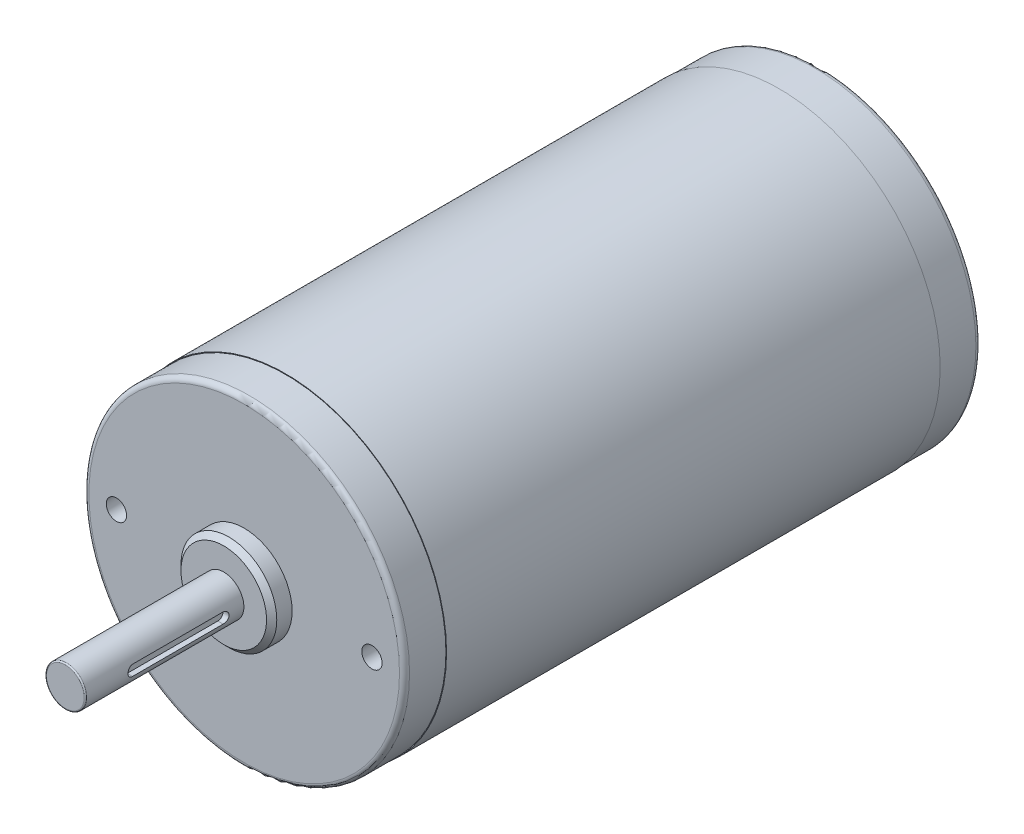
ISO-10303-21;
HEADER;
FILE_DESCRIPTION(('STEP AP214'),'2;1');
FILE_NAME('part.step','',(''),(''),'','','');
FILE_SCHEMA(('AUTOMOTIVE_DESIGN { 1 0 10303 214 1 1 1 1 }'));
ENDSEC;
DATA;
#1=APPLICATION_CONTEXT('core data for automotive mechanical design processes');
#2=APPLICATION_PROTOCOL_DEFINITION('international standard','automotive_design',2000,#1);
#3=PRODUCT_CONTEXT('',#1,'mechanical');
#4=PRODUCT('Part','Part','',(#3));
#5=PRODUCT_RELATED_PRODUCT_CATEGORY('part','',(#4));
#6=PRODUCT_DEFINITION_FORMATION('','',#4);
#7=PRODUCT_DEFINITION_CONTEXT('part definition',#1,'design');
#8=PRODUCT_DEFINITION('design','',#6,#7);
#9=PRODUCT_DEFINITION_SHAPE('','',#8);
#10=(LENGTH_UNIT() NAMED_UNIT(*) SI_UNIT(.MILLI.,.METRE.));
#11=(NAMED_UNIT(*) PLANE_ANGLE_UNIT() SI_UNIT($,.RADIAN.));
#12=(NAMED_UNIT(*) SI_UNIT($,.STERADIAN.) SOLID_ANGLE_UNIT());
#13=UNCERTAINTY_MEASURE_WITH_UNIT(LENGTH_MEASURE(1.E-05),#10,'distance_accuracy_value','');
#14=(GEOMETRIC_REPRESENTATION_CONTEXT(3) GLOBAL_UNCERTAINTY_ASSIGNED_CONTEXT((#13)) GLOBAL_UNIT_ASSIGNED_CONTEXT((#10,
#11,#12)) REPRESENTATION_CONTEXT('',''));
#15=CARTESIAN_POINT('',(0.,0.,0.));
#16=DIRECTION('',(0.,0.,1.));
#17=DIRECTION('',(1.,0.,0.));
#18=AXIS2_PLACEMENT_3D('',#15,#16,#17);
#19=CARTESIAN_POINT('',(35.56,109.2962,54.614));
#20=DIRECTION('',(0.,0.,1.));
#21=DIRECTION('',(1.,0.,0.));
#22=AXIS2_PLACEMENT_3D('',#19,#20,#21);
#23=PLANE('',#22);
#24=CARTESIAN_POINT('',(35.56,109.2962,54.614));
#25=DIRECTION('',(0.,0.,-1.));
#26=DIRECTION('',(1.,0.,0.));
#27=AXIS2_PLACEMENT_3D('',#24,#25,#26);
#28=CIRCLE('',#27,3.7460000000201);
#29=CARTESIAN_POINT('',(39.3060000000201,109.2962,54.614));
#30=VERTEX_POINT('',#29);
#31=EDGE_CURVE('E76',#30,#30,#28,.T.);
#32=ORIENTED_EDGE('',*,*,#31,.F.);
#33=EDGE_LOOP('',(#32));
#34=FACE_BOUND('',#33,.T.);
#35=ADVANCED_FACE('F17',(#34),#23,.T.);
#36=CARTESIAN_POINT('',(38.36,109.2962,16.4984772078548));
#37=DIRECTION('',(1.,0.,0.));
#38=DIRECTION('',(0.,0.,-1.));
#39=AXIS2_PLACEMENT_3D('',#36,#37,#38);
#40=PLANE('',#39);
#41=DIRECTION('',(0.,0.,1.));
#42=VECTOR('',#41,1.);
#43=CARTESIAN_POINT('',(38.36,108.2462,16.4984772078548));
#44=LINE('',#43,#42);
#45=CARTESIAN_POINT('',(38.36,108.2462,27.1));
#46=VERTEX_POINT('',#45);
#47=CARTESIAN_POINT('',(38.36,108.2462,45.1));
#48=VERTEX_POINT('',#47);
#49=EDGE_CURVE('E58',#46,#48,#44,.T.);
#50=ORIENTED_EDGE('',*,*,#49,.F.);
#51=CARTESIAN_POINT('',(38.36,109.2962,27.1));
#52=DIRECTION('',(-1.,0.,0.));
#53=DIRECTION('',(0.,0.,1.));
#54=AXIS2_PLACEMENT_3D('',#51,#52,#53);
#55=CIRCLE('',#54,1.05);
#56=CARTESIAN_POINT('',(38.36,110.3462,27.1));
#57=VERTEX_POINT('',#56);
#58=EDGE_CURVE('E21',#46,#57,#55,.F.);
#59=ORIENTED_EDGE('',*,*,#58,.T.);
#60=DIRECTION('',(0.,0.,1.));
#61=VECTOR('',#60,1.);
#62=CARTESIAN_POINT('',(38.36,110.3462,16.4984772078548));
#63=LINE('',#62,#61);
#64=CARTESIAN_POINT('',(38.36,110.3462,45.1));
#65=VERTEX_POINT('',#64);
#66=EDGE_CURVE('E88',#57,#65,#63,.T.);
#67=ORIENTED_EDGE('',*,*,#66,.T.);
#68=CARTESIAN_POINT('',(38.36,109.2962,45.1));
#69=DIRECTION('',(-1.,0.,0.));
#70=DIRECTION('',(0.,0.,1.));
#71=AXIS2_PLACEMENT_3D('',#68,#69,#70);
#72=CIRCLE('',#71,1.05);
#73=EDGE_CURVE('E63',#65,#48,#72,.F.);
#74=ORIENTED_EDGE('',*,*,#73,.T.);
#75=EDGE_LOOP('',(#50,#59,#67,#74));
#76=FACE_BOUND('',#75,.T.);
#77=ADVANCED_FACE('F60',(#76),#40,.T.);
#78=CARTESIAN_POINT('',(35.56,109.2962,54.36));
#79=DIRECTION('',(0.,0.,1.));
#80=DIRECTION('',(1.,0.,0.));
#81=AXIS2_PLACEMENT_3D('',#78,#79,#80);
#82=TOROIDAL_SURFACE('',#81,3.746,0.254);
#83=CARTESIAN_POINT('',(35.56,109.2962,54.36000000001));
#84=DIRECTION('',(0.,0.,1.));
#85=DIRECTION('',(1.,0.,0.));
#86=AXIS2_PLACEMENT_3D('',#83,#84,#85);
#87=CIRCLE('',#86,4.);
#88=CARTESIAN_POINT('',(39.56,109.2962,54.36000000001));
#89=VERTEX_POINT('',#88);
#90=EDGE_CURVE('E330',#89,#89,#87,.F.);
#91=ORIENTED_EDGE('',*,*,#90,.F.);
#92=EDGE_LOOP('',(#91));
#93=FACE_BOUND('',#92,.T.);
#94=ORIENTED_EDGE('',*,*,#31,.T.);
#95=EDGE_LOOP('',(#94));
#96=FACE_BOUND('',#95,.T.);
#97=ADVANCED_FACE('F90',(#93,#96),#82,.T.);
#98=CARTESIAN_POINT('',(38.36,109.2962,27.1));
#99=DIRECTION('',(-1.,0.,0.));
#100=DIRECTION('',(0.,0.,1.));
#101=AXIS2_PLACEMENT_3D('',#98,#99,#100);
#102=CYLINDRICAL_SURFACE('',#101,1.05);
#103=ORIENTED_EDGE('',*,*,#58,.F.);
#104=DIRECTION('',(1.,0.,0.));
#105=VECTOR('',#104,1.);
#106=CARTESIAN_POINT('',(38.36,108.2462,27.1));
#107=LINE('',#106,#105);
#108=CARTESIAN_POINT('',(39.4197279696891,108.2462,27.1));
#109=VERTEX_POINT('',#108);
#110=EDGE_CURVE('E68',#109,#46,#107,.F.);
#111=ORIENTED_EDGE('',*,*,#110,.F.);
#112=CARTESIAN_POINT('',(39.4197279696891,110.3462,27.1));
#113=CARTESIAN_POINT('',(39.4197258950768,110.34620041025,27.0710051009623));
#114=CARTESIAN_POINT('',(39.4200551064328,110.344998227256,27.0420246228058));
#115=CARTESIAN_POINT('',(39.4213547123987,110.340206209835,26.9842814282389));
#116=CARTESIAN_POINT('',(39.4223249908092,110.336616808112,26.9555186733196));
#117=CARTESIAN_POINT('',(39.4261578920523,110.322321932764,26.8699951160553));
#118=CARTESIAN_POINT('',(39.4299428342911,110.308089542303,26.8138236492985));
#119=CARTESIAN_POINT('',(39.4395286889103,110.270686835054,26.7047742036821));
#120=CARTESIAN_POINT('',(39.445329326456,110.247517736714,26.6518957769836));
#121=CARTESIAN_POINT('',(39.4582892232805,110.192930496084,26.5507488556207));
#122=CARTESIAN_POINT('',(39.4654488628843,110.161510043656,26.5024816571346));
#123=CARTESIAN_POINT('',(39.4805119710477,110.090509636998,26.4107922298844));
#124=CARTESIAN_POINT('',(39.4884281885094,110.050767743087,26.3674975328551));
#125=CARTESIAN_POINT('',(39.5040047400554,109.964586854037,26.2880931254824));
#126=CARTESIAN_POINT('',(39.5116649818292,109.91814547434,26.2519859843525));
#127=CARTESIAN_POINT('',(39.526010604883,109.818987620195,26.1874496103786));
#128=CARTESIAN_POINT('',(39.5326785635433,109.766183168704,26.159151481312));
#129=CARTESIAN_POINT('',(39.5441298010582,109.656397945762,26.1119111599868));
#130=CARTESIAN_POINT('',(39.5489153447306,109.599422291421,26.0929577177131));
#131=CARTESIAN_POINT('',(39.5549473168841,109.501171577289,26.0693758272655));
#132=CARTESIAN_POINT('',(39.5568321627735,109.46054623456,26.0621227253234));
#133=CARTESIAN_POINT('',(39.5593590428506,109.378686103609,26.052433965248));
#134=CARTESIAN_POINT('',(39.5600011009139,109.337451327111,26.0499982145665));
#135=CARTESIAN_POINT('',(39.55999845492,109.238305738357,26.0500025057704));
#136=CARTESIAN_POINT('',(39.5587300938833,109.180378877339,26.0548061723029));
#137=CARTESIAN_POINT('',(39.5537908073877,109.066174828257,26.0738680806171));
#138=CARTESIAN_POINT('',(39.5501176251492,109.009899241695,26.0881352034471));
#139=CARTESIAN_POINT('',(39.5407752151886,108.900688958064,26.1256289904428));
#140=CARTESIAN_POINT('',(39.5351088856793,108.847749541003,26.148842650214));
#141=CARTESIAN_POINT('',(39.5223803452477,108.746519851806,26.2035277086069));
#142=CARTESIAN_POINT('',(39.5153181479082,108.698229534436,26.2349990268771));
#143=CARTESIAN_POINT('',(39.5003832391546,108.606575585264,26.3060552920619));
#144=CARTESIAN_POINT('',(39.4924970081333,108.563331555532,26.3457916691671));
#145=CARTESIAN_POINT('',(39.4768899553604,108.484036309153,26.431929982209));
#146=CARTESIAN_POINT('',(39.4691691622904,108.447986330864,26.4783330633665));
#147=CARTESIAN_POINT('',(39.4546281048764,108.383519395399,26.5774412854526));
#148=CARTESIAN_POINT('',(39.4478252173029,108.355241372008,26.6302394851058));
#149=CARTESIAN_POINT('',(39.4360941322254,108.308025058775,26.7400354515098));
#150=CARTESIAN_POINT('',(39.4311644713834,108.289079475123,26.7970298984879));
#151=CARTESIAN_POINT('',(39.424947536189,108.265530062073,26.8952701656664));
#152=CARTESIAN_POINT('',(39.4230031721685,108.258293447667,26.9358624533813));
#153=CARTESIAN_POINT('',(39.4203876966156,108.248624950633,27.0176289590907));
#154=CARTESIAN_POINT('',(39.4197157897859,108.246190066839,27.058802797386));
#155=CARTESIAN_POINT('',(39.4197279696891,108.2462,27.1));
#156=B_SPLINE_CURVE_WITH_KNOTS('',3,(#112,#113,#114,#115,#116,#117,#118,#119,#120,#121,#122,
#123,#124,#125,#126,#127,#128,#129,#130,#131,#132,#133,#134,#135,#136,#137,#138,#139,#140,#141,
#142,#143,#144,#145,#146,#147,#148,#149,#150,#151,#152,#153,#154,#155),.UNSPECIFIED.,.F.,.F.,(4,
2,2,2,2,2,2,2,2,2,2,2,2,2,2,2,2,2,2,2,2,4),(0.,0.0869295778834455,0.173843403286118,
0.347151826879624,0.520436629596133,0.693769998810187,0.870856390838599,1.04800596970822,
1.22797015523126,1.40771715061753,1.53136439682191,1.65500926755904,1.8285389209936,
2.00223165541559,2.17567286221396,2.34911238140169,2.52606492372391,2.70304789975981,
2.88301467869372,3.06284057971519,3.18638852057382,3.30985921734619),.UNSPECIFIED.);
#157=CARTESIAN_POINT('',(39.4197279696891,110.3462,27.1));
#158=VERTEX_POINT('',#157);
#159=EDGE_CURVE('E161',#158,#109,#156,.T.);
#160=ORIENTED_EDGE('',*,*,#159,.F.);
#161=DIRECTION('',(1.,0.,0.));
#162=VECTOR('',#161,1.);
#163=CARTESIAN_POINT('',(38.36,110.3462,27.1));
#164=LINE('',#163,#162);
#165=EDGE_CURVE('E74',#158,#57,#164,.F.);
#166=ORIENTED_EDGE('',*,*,#165,.T.);
#167=EDGE_LOOP('',(#103,#111,#160,#166));
#168=FACE_BOUND('',#167,.T.);
#169=ADVANCED_FACE('F71',(#168),#102,.F.);
#170=CARTESIAN_POINT('',(38.36,108.2462,16.4984772078548));
#171=DIRECTION('',(0.,1.,0.));
#172=DIRECTION('',(0.,0.,1.));
#173=AXIS2_PLACEMENT_3D('',#170,#171,#172);
#174=PLANE('',#173);
#175=DIRECTION('',(0.,0.,1.));
#176=VECTOR('',#175,1.);
#177=CARTESIAN_POINT('',(39.4197279696891,108.2462,54.614));
#178=LINE('',#177,#176);
#179=CARTESIAN_POINT('',(39.4197279696891,108.2462,45.1));
#180=VERTEX_POINT('',#179);
#181=EDGE_CURVE('E79',#109,#180,#178,.T.);
#182=ORIENTED_EDGE('',*,*,#181,.F.);
#183=ORIENTED_EDGE('',*,*,#110,.T.);
#184=ORIENTED_EDGE('',*,*,#49,.T.);
#185=DIRECTION('',(-1.,0.,0.));
#186=VECTOR('',#185,1.);
#187=CARTESIAN_POINT('',(38.36,108.2462,45.1));
#188=LINE('',#187,#186);
#189=EDGE_CURVE('E82',#48,#180,#188,.F.);
#190=ORIENTED_EDGE('',*,*,#189,.T.);
#191=EDGE_LOOP('',(#182,#183,#184,#190));
#192=FACE_BOUND('',#191,.T.);
#193=ADVANCED_FACE('F77',(#192),#174,.T.);
#194=CARTESIAN_POINT('',(38.36,109.2962,45.1));
#195=DIRECTION('',(-1.,0.,0.));
#196=DIRECTION('',(0.,0.,1.));
#197=AXIS2_PLACEMENT_3D('',#194,#195,#196);
#198=CYLINDRICAL_SURFACE('',#197,1.05);
#199=ORIENTED_EDGE('',*,*,#73,.F.);
#200=DIRECTION('',(1.,0.,0.));
#201=VECTOR('',#200,1.);
#202=CARTESIAN_POINT('',(38.36,110.3462,45.1));
#203=LINE('',#202,#201);
#204=CARTESIAN_POINT('',(39.4197279696891,110.3462,45.1));
#205=VERTEX_POINT('',#204);
#206=EDGE_CURVE('E333',#65,#205,#203,.T.);
#207=ORIENTED_EDGE('',*,*,#206,.T.);
#208=CARTESIAN_POINT('',(39.4197279696891,108.2462,45.1));
#209=CARTESIAN_POINT('',(39.4197258950768,108.24619958975,45.1289948990377));
#210=CARTESIAN_POINT('',(39.4200551064328,108.247401772744,45.1579753771942));
#211=CARTESIAN_POINT('',(39.4213547123987,108.252193790165,45.2157185717611));
#212=CARTESIAN_POINT('',(39.4223249908092,108.255783191888,45.2444813266804));
#213=CARTESIAN_POINT('',(39.4261578920523,108.270078067236,45.3300048839447));
#214=CARTESIAN_POINT('',(39.4299428342911,108.284310457697,45.3861763507015));
#215=CARTESIAN_POINT('',(39.4395286889103,108.321713164946,45.4952257963179));
#216=CARTESIAN_POINT('',(39.445329326456,108.344882263286,45.5481042230164));
#217=CARTESIAN_POINT('',(39.4582892232805,108.399469503916,45.6492511443793));
#218=CARTESIAN_POINT('',(39.4654488628843,108.430889956344,45.6975183428654));
#219=CARTESIAN_POINT('',(39.4805119710477,108.501890363002,45.7892077701156));
#220=CARTESIAN_POINT('',(39.4884281885094,108.541632256913,45.8325024671449));
#221=CARTESIAN_POINT('',(39.5040047400554,108.627813145963,45.9119068745175));
#222=CARTESIAN_POINT('',(39.5116649818292,108.67425452566,45.9480140156475));
#223=CARTESIAN_POINT('',(39.526010604883,108.773412379805,46.0125503896214));
#224=CARTESIAN_POINT('',(39.5326785635433,108.826216831296,46.040848518688));
#225=CARTESIAN_POINT('',(39.5441298010582,108.936002054238,46.0880888400132));
#226=CARTESIAN_POINT('',(39.5489153447306,108.992977708579,46.1070422822868));
#227=CARTESIAN_POINT('',(39.5549473168841,109.091228422711,46.1306241727345));
#228=CARTESIAN_POINT('',(39.5568321627735,109.13185376544,46.1378772746766));
#229=CARTESIAN_POINT('',(39.5593590428506,109.213713896391,46.147566034752));
#230=CARTESIAN_POINT('',(39.560001100914,109.254948672889,46.1500017854335));
#231=CARTESIAN_POINT('',(39.55999845492,109.354094261643,46.1499974942296));
#232=CARTESIAN_POINT('',(39.5587300938833,109.412021122661,46.1451938276971));
#233=CARTESIAN_POINT('',(39.5537908073877,109.526225171743,46.1261319193829));
#234=CARTESIAN_POINT('',(39.5501176251492,109.582500758305,46.1118647965529));
#235=CARTESIAN_POINT('',(39.5407752151886,109.691711041936,46.0743710095572));
#236=CARTESIAN_POINT('',(39.5351088856793,109.744650458997,46.051157349786));
#237=CARTESIAN_POINT('',(39.5223803452477,109.845880148194,45.9964722913931));
#238=CARTESIAN_POINT('',(39.5153181479082,109.894170465564,45.9650009731229));
#239=CARTESIAN_POINT('',(39.5003832391546,109.985824414736,45.8939447079381));
#240=CARTESIAN_POINT('',(39.4924970081333,110.029068444468,45.8542083308329));
#241=CARTESIAN_POINT('',(39.4768899553604,110.108363690847,45.768070017791));
#242=CARTESIAN_POINT('',(39.4691691622904,110.144413669136,45.7216669366335));
#243=CARTESIAN_POINT('',(39.4546281048764,110.208880604601,45.6225587145474));
#244=CARTESIAN_POINT('',(39.4478252173029,110.237158627992,45.5697605148942));
#245=CARTESIAN_POINT('',(39.4360941322254,110.284374941225,45.4599645484902));
#246=CARTESIAN_POINT('',(39.4311644713834,110.303320524877,45.4029701015121));
#247=CARTESIAN_POINT('',(39.424947536189,110.326869937927,45.3047298343336));
#248=CARTESIAN_POINT('',(39.4230031721685,110.334106552333,45.2641375466187));
#249=CARTESIAN_POINT('',(39.4203876966156,110.343775049367,45.1823710409093));
#250=CARTESIAN_POINT('',(39.4197157897859,110.346209933161,45.141197202614));
#251=CARTESIAN_POINT('',(39.4197279696891,110.3462,45.1));
#252=B_SPLINE_CURVE_WITH_KNOTS('',3,(#208,#209,#210,#211,#212,#213,#214,#215,#216,#217,#218,
#219,#220,#221,#222,#223,#224,#225,#226,#227,#228,#229,#230,#231,#232,#233,#234,#235,#236,#237,
#238,#239,#240,#241,#242,#243,#244,#245,#246,#247,#248,#249,#250,#251),.UNSPECIFIED.,.F.,.F.,(4,
2,2,2,2,2,2,2,2,2,2,2,2,2,2,2,2,2,2,2,2,4),(0.,0.0869295778834421,0.173843403286125,
0.347151826879624,0.520436629596126,0.693769998810186,0.870856390838596,1.04800596970822,
1.22797015523124,1.40771715061751,1.53136439682191,1.65500926755904,1.8285389209936,
2.00223165541559,2.17567286221396,2.34911238140169,2.52606492372391,2.70304789975981,
2.88301467869373,3.0628405797152,3.18638852057382,3.30985921734619),.UNSPECIFIED.);
#253=EDGE_CURVE('E153',#180,#205,#252,.T.);
#254=ORIENTED_EDGE('',*,*,#253,.F.);
#255=ORIENTED_EDGE('',*,*,#189,.F.);
#256=EDGE_LOOP('',(#199,#207,#254,#255));
#257=FACE_BOUND('',#256,.T.);
#258=ADVANCED_FACE('F165',(#257),#198,.F.);
#259=CARTESIAN_POINT('',(38.36,110.3462,16.4984772078548));
#260=DIRECTION('',(0.,1.,0.));
#261=DIRECTION('',(0.,0.,1.));
#262=AXIS2_PLACEMENT_3D('',#259,#260,#261);
#263=PLANE('',#262);
#264=ORIENTED_EDGE('',*,*,#206,.F.);
#265=ORIENTED_EDGE('',*,*,#66,.F.);
#266=ORIENTED_EDGE('',*,*,#165,.F.);
#267=DIRECTION('',(0.,0.,1.));
#268=VECTOR('',#267,1.);
#269=CARTESIAN_POINT('',(39.4197279696891,110.3462,54.614));
#270=LINE('',#269,#268);
#271=EDGE_CURVE('E152',#205,#158,#270,.F.);
#272=ORIENTED_EDGE('',*,*,#271,.F.);
#273=EDGE_LOOP('',(#264,#265,#266,#272));
#274=FACE_BOUND('',#273,.T.);
#275=ADVANCED_FACE('F173',(#274),#263,.F.);
#276=CARTESIAN_POINT('',(35.56,109.2962,54.614));
#277=DIRECTION('',(0.,0.,1.));
#278=DIRECTION('',(1.,0.,0.));
#279=AXIS2_PLACEMENT_3D('',#276,#277,#278);
#280=CYLINDRICAL_SURFACE('',#279,4.);
#281=ORIENTED_EDGE('',*,*,#253,.T.);
#282=ORIENTED_EDGE('',*,*,#271,.T.);
#283=ORIENTED_EDGE('',*,*,#159,.T.);
#284=ORIENTED_EDGE('',*,*,#181,.T.);
#285=EDGE_LOOP('',(#281,#282,#283,#284));
#286=FACE_BOUND('',#285,.T.);
#287=ORIENTED_EDGE('',*,*,#90,.T.);
#288=EDGE_LOOP('',(#287));
#289=FACE_BOUND('',#288,.T.);
#290=CARTESIAN_POINT('',(35.56,109.2962,23.11400000001));
#291=DIRECTION('',(0.,0.,1.));
#292=DIRECTION('',(1.,0.,0.));
#293=AXIS2_PLACEMENT_3D('',#290,#291,#292);
#294=CIRCLE('',#293,4.);
#295=CARTESIAN_POINT('',(39.56,109.2962,23.11400000001));
#296=VERTEX_POINT('',#295);
#297=EDGE_CURVE('E149',#296,#296,#294,.F.);
#298=ORIENTED_EDGE('',*,*,#297,.F.);
#299=EDGE_LOOP('',(#298));
#300=FACE_BOUND('',#299,.T.);
#301=ADVANCED_FACE('F168',(#286,#289,#300),#280,.T.);
#302=CARTESIAN_POINT('',(48.8853596371201,127.903290682857,-97.8026999980236));
#303=DIRECTION('',(0.,0.,-1.));
#304=DIRECTION('',(-1.,0.,0.));
#305=AXIS2_PLACEMENT_3D('',#302,#303,#304);
#306=PLANE('',#305);
#307=CARTESIAN_POINT('',(46.76735963712,127.903290682857,-97.8026999970893));
#308=DIRECTION('',(0.,0.,1.));
#309=DIRECTION('',(1.,0.,0.));
#310=AXIS2_PLACEMENT_3D('',#307,#308,#309);
#311=CIRCLE('',#310,2.1179999989541);
#312=CARTESIAN_POINT('',(48.8853596360741,127.903290682857,-97.8026999970893));
#313=VERTEX_POINT('',#312);
#314=EDGE_CURVE('E146',#313,#313,#311,.T.);
#315=ORIENTED_EDGE('',*,*,#314,.F.);
#316=EDGE_LOOP('',(#315));
#317=FACE_BOUND('',#316,.T.);
#318=ADVANCED_FACE('F172',(#317),#306,.T.);
#319=CARTESIAN_POINT('',(56.2850906808812,120.503559639096,-97.8026999980238));
#320=DIRECTION('',(0.,0.,-1.));
#321=DIRECTION('',(-1.,0.,0.));
#322=AXIS2_PLACEMENT_3D('',#319,#320,#321);
#323=PLANE('',#322);
#324=CARTESIAN_POINT('',(54.1670906808811,120.503559639096,-97.8026999970325));
#325=DIRECTION('',(0.,0.,1.));
#326=DIRECTION('',(1.,0.,0.));
#327=AXIS2_PLACEMENT_3D('',#324,#325,#326);
#328=CIRCLE('',#327,2.11799999904017);
#329=CARTESIAN_POINT('',(56.2850906799213,120.503559639096,-97.8026999970325));
#330=VERTEX_POINT('',#329);
#331=EDGE_CURVE('E143',#330,#330,#328,.T.);
#332=ORIENTED_EDGE('',*,*,#331,.F.);
#333=EDGE_LOOP('',(#332));
#334=FACE_BOUND('',#333,.T.);
#335=ADVANCED_FACE('F426',(#334),#323,.T.);
#336=CARTESIAN_POINT('',(35.56,109.2962,-100.317299999998));
#337=DIRECTION('',(0.,0.,-1.));
#338=DIRECTION('',(-1.,0.,0.));
#339=AXIS2_PLACEMENT_3D('',#336,#337,#338);
#340=PLANE('',#339);
#341=CARTESIAN_POINT('',(35.56,109.2962,-100.317299999998));
#342=DIRECTION('',(0.,0.,1.));
#343=DIRECTION('',(-1.,0.,0.));
#344=AXIS2_PLACEMENT_3D('',#341,#342,#343);
#345=CIRCLE('',#344,14.0368000000003);
#346=CARTESIAN_POINT('',(21.5231999999997,109.2962,-100.317299999998));
#347=VERTEX_POINT('',#346);
#348=EDGE_CURVE('E142',#347,#347,#345,.T.);
#349=ORIENTED_EDGE('',*,*,#348,.F.);
#350=EDGE_LOOP('',(#349));
#351=FACE_BOUND('',#350,.T.);
#352=ADVANCED_FACE('F346',(#351),#340,.T.);
#353=CARTESIAN_POINT('',(35.56,109.2962,23.114));
#354=DIRECTION('',(0.,0.,1.));
#355=DIRECTION('',(1.,0.,0.));
#356=AXIS2_PLACEMENT_3D('',#353,#354,#355);
#357=PLANE('',#356);
#358=ORIENTED_EDGE('',*,*,#297,.T.);
#359=EDGE_LOOP('',(#358));
#360=FACE_BOUND('',#359,.T.);
#361=CARTESIAN_POINT('',(35.56,109.2962,23.1139999999949));
#362=DIRECTION('',(0.,0.,-1.));
#363=DIRECTION('',(-1.,0.,0.));
#364=AXIS2_PLACEMENT_3D('',#361,#362,#363);
#365=CIRCLE('',#364,8.5090000018283);
#366=CARTESIAN_POINT('',(27.0509999981717,109.2962,23.1139999999949));
#367=VERTEX_POINT('',#366);
#368=EDGE_CURVE('E138',#367,#367,#365,.T.);
#369=ORIENTED_EDGE('',*,*,#368,.F.);
#370=EDGE_LOOP('',(#369));
#371=FACE_BOUND('',#370,.T.);
#372=ADVANCED_FACE('F342',(#360,#371),#357,.T.);
#373=CARTESIAN_POINT('',(46.76735963712,127.903290682857,-95.6026999950836));
#374=DIRECTION('',(0.,0.,1.));
#375=DIRECTION('',(1.,0.,0.));
#376=AXIS2_PLACEMENT_3D('',#373,#374,#375);
#377=CONICAL_SURFACE('',#376,4.31800000095981,0.785398163397448);
#378=ORIENTED_EDGE('',*,*,#314,.T.);
#379=EDGE_LOOP('',(#378));
#380=FACE_BOUND('',#379,.T.);
#381=CARTESIAN_POINT('',(46.76735963712,127.903290682857,-95.6026999960591));
#382=DIRECTION('',(0.,0.,-1.));
#383=DIRECTION('',(-1.,0.,0.));
#384=AXIS2_PLACEMENT_3D('',#381,#382,#383);
#385=CIRCLE('',#384,4.318);
#386=CARTESIAN_POINT('',(42.44935963712,127.903290682857,-95.6026999960591));
#387=VERTEX_POINT('',#386);
#388=EDGE_CURVE('E141',#387,#387,#385,.F.);
#389=ORIENTED_EDGE('',*,*,#388,.F.);
#390=EDGE_LOOP('',(#389));
#391=FACE_BOUND('',#390,.T.);
#392=ADVANCED_FACE('F345',(#380,#391),#377,.T.);
#393=CARTESIAN_POINT('',(54.1670906808811,120.503559639096,-95.6026999950268));
#394=DIRECTION('',(0.,0.,1.));
#395=DIRECTION('',(1.,0.,0.));
#396=AXIS2_PLACEMENT_3D('',#393,#394,#395);
#397=CONICAL_SURFACE('',#396,4.31800000104587,0.785398163397448);
#398=ORIENTED_EDGE('',*,*,#331,.T.);
#399=EDGE_LOOP('',(#398));
#400=FACE_BOUND('',#399,.T.);
#401=CARTESIAN_POINT('',(54.1670906808811,120.503559639096,-95.6026999960594));
#402=DIRECTION('',(0.,0.,-1.));
#403=DIRECTION('',(-1.,0.,0.));
#404=AXIS2_PLACEMENT_3D('',#401,#402,#403);
#405=CIRCLE('',#404,4.318);
#406=CARTESIAN_POINT('',(49.8490906808811,120.503559639096,-95.6026999960594));
#407=VERTEX_POINT('',#406);
#408=EDGE_CURVE('E290',#407,#407,#405,.F.);
#409=ORIENTED_EDGE('',*,*,#408,.F.);
#410=EDGE_LOOP('',(#409));
#411=FACE_BOUND('',#410,.T.);
#412=ADVANCED_FACE('F312',(#400,#411),#397,.T.);
#413=CARTESIAN_POINT('',(35.56,109.2962,-99.317299999998));
#414=DIRECTION('',(0.,0.,-1.));
#415=DIRECTION('',(-1.,0.,0.));
#416=AXIS2_PLACEMENT_3D('',#413,#414,#415);
#417=TOROIDAL_SURFACE('',#416,14.0368,1.);
#418=CARTESIAN_POINT('',(35.56,109.2962,-99.317300000008));
#419=DIRECTION('',(0.,0.,-1.));
#420=DIRECTION('',(-1.,0.,0.));
#421=AXIS2_PLACEMENT_3D('',#418,#419,#420);
#422=CIRCLE('',#421,15.0368);
#423=CARTESIAN_POINT('',(20.5232,109.2962,-99.317300000008));
#424=VERTEX_POINT('',#423);
#425=EDGE_CURVE('E285',#424,#424,#422,.F.);
#426=ORIENTED_EDGE('',*,*,#425,.F.);
#427=EDGE_LOOP('',(#426));
#428=FACE_BOUND('',#427,.T.);
#429=ORIENTED_EDGE('',*,*,#348,.T.);
#430=EDGE_LOOP('',(#429));
#431=FACE_BOUND('',#430,.T.);
#432=ADVANCED_FACE('F306',(#428,#431),#417,.T.);
#433=CARTESIAN_POINT('',(10.1599999999994,109.2962,5.43559999999843));
#434=DIRECTION('',(0.,0.,1.));
#435=DIRECTION('',(1.,0.,0.));
#436=AXIS2_PLACEMENT_3D('',#433,#434,#435);
#437=CONICAL_SURFACE('',#436,2.01930000001448,1.02974425749912);
#438=CARTESIAN_POINT('',(10.1599999999848,109.2962,4.22228214875986));
#439=VERTEX_POINT('',#438);
#440=VERTEX_LOOP('',#439);
#441=FACE_BOUND('',#440,.T.);
#442=CARTESIAN_POINT('',(10.1599999999994,109.2962,5.4356000000107));
#443=DIRECTION('',(0.,0.,-1.));
#444=DIRECTION('',(-1.,0.,0.));
#445=AXIS2_PLACEMENT_3D('',#442,#443,#444);
#446=CIRCLE('',#445,2.0193);
#447=CARTESIAN_POINT('',(8.1406999999994,109.2962,5.4356000000107));
#448=VERTEX_POINT('',#447);
#449=EDGE_CURVE('E280',#448,#448,#446,.F.);
#450=ORIENTED_EDGE('',*,*,#449,.T.);
#451=EDGE_LOOP('',(#450));
#452=FACE_BOUND('',#451,.T.);
#453=ADVANCED_FACE('F311',(#441,#452),#437,.F.);
#454=CARTESIAN_POINT('',(60.96,109.2962,5.43559999988474));
#455=DIRECTION('',(0.,0.,1.));
#456=DIRECTION('',(1.,0.,0.));
#457=AXIS2_PLACEMENT_3D('',#454,#455,#456);
#458=CONICAL_SURFACE('',#457,2.01929999976759,1.02974425734563);
#459=CARTESIAN_POINT('',(60.9599999998522,109.2962,4.22228214870302));
#460=VERTEX_POINT('',#459);
#461=VERTEX_LOOP('',#460);
#462=FACE_BOUND('',#461,.T.);
#463=CARTESIAN_POINT('',(60.96,109.2962,5.43560000001074));
#464=DIRECTION('',(0.,0.,-1.));
#465=DIRECTION('',(-1.,0.,0.));
#466=AXIS2_PLACEMENT_3D('',#463,#464,#465);
#467=CIRCLE('',#466,2.0193);
#468=CARTESIAN_POINT('',(58.9407,109.2962,5.43560000001074));
#469=VERTEX_POINT('',#468);
#470=EDGE_CURVE('E275',#469,#469,#467,.F.);
#471=ORIENTED_EDGE('',*,*,#470,.T.);
#472=EDGE_LOOP('',(#471));
#473=FACE_BOUND('',#472,.T.);
#474=ADVANCED_FACE('F354',(#462,#473),#458,.F.);
#475=CARTESIAN_POINT('',(35.56,109.2962,22.0979999999945));
#476=DIRECTION('',(0.,0.,-1.));
#477=DIRECTION('',(-1.,0.,0.));
#478=AXIS2_PLACEMENT_3D('',#475,#476,#477);
#479=CONICAL_SURFACE('',#478,9.5250000000051,0.7853981625);
#480=ORIENTED_EDGE('',*,*,#368,.T.);
#481=EDGE_LOOP('',(#480));
#482=FACE_BOUND('',#481,.T.);
#483=CARTESIAN_POINT('',(35.56,109.2962,22.0980000000096));
#484=DIRECTION('',(0.,0.,1.));
#485=DIRECTION('',(1.,0.,0.));
#486=AXIS2_PLACEMENT_3D('',#483,#484,#485);
#487=CIRCLE('',#486,9.525);
#488=CARTESIAN_POINT('',(45.085,109.2962,22.0980000000096));
#489=VERTEX_POINT('',#488);
#490=EDGE_CURVE('E137',#489,#489,#487,.F.);
#491=ORIENTED_EDGE('',*,*,#490,.F.);
#492=EDGE_LOOP('',(#491));
#493=FACE_BOUND('',#492,.T.);
#494=ADVANCED_FACE('F350',(#482,#493),#479,.T.);
#495=CARTESIAN_POINT('',(46.76735963712,127.903290682857,-97.8026999980236));
#496=DIRECTION('',(0.,0.,-1.));
#497=DIRECTION('',(-1.,0.,0.));
#498=AXIS2_PLACEMENT_3D('',#495,#496,#497);
#499=CYLINDRICAL_SURFACE('',#498,4.318);
#500=ORIENTED_EDGE('',*,*,#388,.T.);
#501=EDGE_LOOP('',(#500));
#502=FACE_BOUND('',#501,.T.);
#503=CARTESIAN_POINT('',(46.76735963712,127.903290682857,-95.554800000008));
#504=DIRECTION('',(0.,0.,-1.));
#505=DIRECTION('',(-1.,0.,0.));
#506=AXIS2_PLACEMENT_3D('',#503,#504,#505);
#507=CIRCLE('',#506,4.318);
#508=CARTESIAN_POINT('',(42.44935963712,127.903290682857,-95.554800000008));
#509=VERTEX_POINT('',#508);
#510=EDGE_CURVE('E134',#509,#509,#507,.F.);
#511=ORIENTED_EDGE('',*,*,#510,.F.);
#512=EDGE_LOOP('',(#511));
#513=FACE_BOUND('',#512,.T.);
#514=ADVANCED_FACE('F353',(#502,#513),#499,.T.);
#515=CARTESIAN_POINT('',(54.1670906808811,120.503559639096,-97.8026999980238));
#516=DIRECTION('',(0.,0.,-1.));
#517=DIRECTION('',(-1.,0.,0.));
#518=AXIS2_PLACEMENT_3D('',#515,#516,#517);
#519=CYLINDRICAL_SURFACE('',#518,4.318);
#520=ORIENTED_EDGE('',*,*,#408,.T.);
#521=EDGE_LOOP('',(#520));
#522=FACE_BOUND('',#521,.T.);
#523=CARTESIAN_POINT('',(54.1670906808811,120.503559639096,-95.554800000008));
#524=DIRECTION('',(0.,0.,-1.));
#525=DIRECTION('',(-1.,0.,0.));
#526=AXIS2_PLACEMENT_3D('',#523,#524,#525);
#527=CIRCLE('',#526,4.318);
#528=CARTESIAN_POINT('',(49.8490906808811,120.503559639096,-95.554800000008));
#529=VERTEX_POINT('',#528);
#530=EDGE_CURVE('E131',#529,#529,#527,.F.);
#531=ORIENTED_EDGE('',*,*,#530,.F.);
#532=EDGE_LOOP('',(#531));
#533=FACE_BOUND('',#532,.T.);
#534=ADVANCED_FACE('F377',(#522,#533),#519,.T.);
#535=CARTESIAN_POINT('',(35.56,109.2962,-100.317299999998));
#536=DIRECTION('',(0.,0.,-1.));
#537=DIRECTION('',(-1.,0.,0.));
#538=AXIS2_PLACEMENT_3D('',#535,#536,#537);
#539=CYLINDRICAL_SURFACE('',#538,15.0368);
#540=ORIENTED_EDGE('',*,*,#425,.T.);
#541=EDGE_LOOP('',(#540));
#542=FACE_BOUND('',#541,.T.);
#543=CARTESIAN_POINT('',(35.56,109.2962,-95.554800000008));
#544=DIRECTION('',(0.,0.,-1.));
#545=DIRECTION('',(-1.,0.,0.));
#546=AXIS2_PLACEMENT_3D('',#543,#544,#545);
#547=CIRCLE('',#546,15.0368);
#548=CARTESIAN_POINT('',(20.5232,109.2962,-95.554800000008));
#549=VERTEX_POINT('',#548);
#550=EDGE_CURVE('E128',#549,#549,#547,.F.);
#551=ORIENTED_EDGE('',*,*,#550,.F.);
#552=EDGE_LOOP('',(#551));
#553=FACE_BOUND('',#552,.T.);
#554=ADVANCED_FACE('F369',(#542,#553),#539,.T.);
#555=CARTESIAN_POINT('',(10.1599999999994,109.2962,19.05));
#556=DIRECTION('',(0.,0.,-1.));
#557=DIRECTION('',(-1.,0.,0.));
#558=AXIS2_PLACEMENT_3D('',#555,#556,#557);
#559=CYLINDRICAL_SURFACE('',#558,2.0193);
#560=ORIENTED_EDGE('',*,*,#449,.F.);
#561=EDGE_LOOP('',(#560));
#562=FACE_BOUND('',#561,.T.);
#563=CARTESIAN_POINT('',(10.1599999999994,109.2962,19.05000000001));
#564=DIRECTION('',(0.,0.,-1.));
#565=DIRECTION('',(-1.,0.,0.));
#566=AXIS2_PLACEMENT_3D('',#563,#564,#565);
#567=CIRCLE('',#566,2.0193);
#568=CARTESIAN_POINT('',(8.1406999999994,109.2962,19.05000000001));
#569=VERTEX_POINT('',#568);
#570=EDGE_CURVE('E125',#569,#569,#567,.T.);
#571=ORIENTED_EDGE('',*,*,#570,.F.);
#572=EDGE_LOOP('',(#571));
#573=FACE_BOUND('',#572,.T.);
#574=ADVANCED_FACE('F367',(#562,#573),#559,.F.);
#575=CARTESIAN_POINT('',(60.96,109.2962,19.05));
#576=DIRECTION('',(0.,0.,-1.));
#577=DIRECTION('',(-1.,0.,0.));
#578=AXIS2_PLACEMENT_3D('',#575,#576,#577);
#579=CYLINDRICAL_SURFACE('',#578,2.0193);
#580=ORIENTED_EDGE('',*,*,#470,.F.);
#581=EDGE_LOOP('',(#580));
#582=FACE_BOUND('',#581,.T.);
#583=CARTESIAN_POINT('',(60.96,109.2962,19.05000000001));
#584=DIRECTION('',(0.,0.,-1.));
#585=DIRECTION('',(-1.,0.,0.));
#586=AXIS2_PLACEMENT_3D('',#583,#584,#585);
#587=CIRCLE('',#586,2.0193);
#588=CARTESIAN_POINT('',(58.9407,109.2962,19.05000000001));
#589=VERTEX_POINT('',#588);
#590=EDGE_CURVE('E122',#589,#589,#587,.T.);
#591=ORIENTED_EDGE('',*,*,#590,.F.);
#592=EDGE_LOOP('',(#591));
#593=FACE_BOUND('',#592,.T.);
#594=ADVANCED_FACE('F360',(#582,#593),#579,.F.);
#595=CARTESIAN_POINT('',(35.56,109.2962,23.114));
#596=DIRECTION('',(0.,0.,1.));
#597=DIRECTION('',(1.,0.,0.));
#598=AXIS2_PLACEMENT_3D('',#595,#596,#597);
#599=CYLINDRICAL_SURFACE('',#598,9.525);
#600=ORIENTED_EDGE('',*,*,#490,.T.);
#601=EDGE_LOOP('',(#600));
#602=FACE_BOUND('',#601,.T.);
#603=CARTESIAN_POINT('',(35.56,109.2962,19.05000000001));
#604=DIRECTION('',(0.,0.,1.));
#605=DIRECTION('',(1.,0.,0.));
#606=AXIS2_PLACEMENT_3D('',#603,#604,#605);
#607=CIRCLE('',#606,9.525);
#608=CARTESIAN_POINT('',(45.085,109.2962,19.05000000001));
#609=VERTEX_POINT('',#608);
#610=EDGE_CURVE('E118',#609,#609,#607,.F.);
#611=ORIENTED_EDGE('',*,*,#610,.F.);
#612=EDGE_LOOP('',(#611));
#613=FACE_BOUND('',#612,.T.);
#614=ADVANCED_FACE('F248',(#602,#613),#599,.T.);
#615=CARTESIAN_POINT('',(35.56,109.2962,-95.554799999998));
#616=DIRECTION('',(0.,0.,-1.));
#617=DIRECTION('',(-1.,0.,0.));
#618=AXIS2_PLACEMENT_3D('',#615,#616,#617);
#619=PLANE('',#618);
#620=ORIENTED_EDGE('',*,*,#550,.T.);
#621=EDGE_LOOP('',(#620));
#622=FACE_BOUND('',#621,.T.);
#623=ORIENTED_EDGE('',*,*,#530,.T.);
#624=EDGE_LOOP('',(#623));
#625=FACE_BOUND('',#624,.T.);
#626=ORIENTED_EDGE('',*,*,#510,.T.);
#627=EDGE_LOOP('',(#626));
#628=FACE_BOUND('',#627,.T.);
#629=CARTESIAN_POINT('',(35.56,109.2962,-95.554799999998));
#630=DIRECTION('',(0.,0.,1.));
#631=DIRECTION('',(-1.,0.,0.));
#632=AXIS2_PLACEMENT_3D('',#629,#630,#631);
#633=CIRCLE('',#632,30.8770000000005);
#634=CARTESIAN_POINT('',(4.6829999999995,109.2962,-95.554799999998));
#635=VERTEX_POINT('',#634);
#636=EDGE_CURVE('E121',#635,#635,#633,.T.);
#637=ORIENTED_EDGE('',*,*,#636,.F.);
#638=EDGE_LOOP('',(#637));
#639=FACE_BOUND('',#638,.T.);
#640=ADVANCED_FACE('F243',(#622,#625,#628,#639),#619,.T.);
#641=CARTESIAN_POINT('',(35.56,109.2962,19.05));
#642=DIRECTION('',(0.,0.,1.));
#643=DIRECTION('',(1.,0.,0.));
#644=AXIS2_PLACEMENT_3D('',#641,#642,#643);
#645=PLANE('',#644);
#646=ORIENTED_EDGE('',*,*,#610,.T.);
#647=EDGE_LOOP('',(#646));
#648=FACE_BOUND('',#647,.T.);
#649=ORIENTED_EDGE('',*,*,#590,.T.);
#650=EDGE_LOOP('',(#649));
#651=FACE_BOUND('',#650,.T.);
#652=ORIENTED_EDGE('',*,*,#570,.T.);
#653=EDGE_LOOP('',(#652));
#654=FACE_BOUND('',#653,.T.);
#655=CARTESIAN_POINT('',(35.56,109.2962,19.05));
#656=DIRECTION('',(0.,0.,-1.));
#657=DIRECTION('',(1.,0.,0.));
#658=AXIS2_PLACEMENT_3D('',#655,#656,#657);
#659=CIRCLE('',#658,30.8770000000205);
#660=CARTESIAN_POINT('',(66.4370000000205,109.2962,19.05));
#661=VERTEX_POINT('',#660);
#662=EDGE_CURVE('E230',#661,#661,#659,.T.);
#663=ORIENTED_EDGE('',*,*,#662,.F.);
#664=EDGE_LOOP('',(#663));
#665=FACE_BOUND('',#664,.T.);
#666=ADVANCED_FACE('F234',(#648,#651,#654,#665),#645,.T.);
#667=CARTESIAN_POINT('',(35.56,109.2962,-94.554799999998));
#668=DIRECTION('',(0.,0.,-1.));
#669=DIRECTION('',(-1.,0.,0.));
#670=AXIS2_PLACEMENT_3D('',#667,#668,#669);
#671=TOROIDAL_SURFACE('',#670,30.877,1.);
#672=CARTESIAN_POINT('',(35.56,109.2962,-94.554800000008));
#673=DIRECTION('',(0.,0.,-1.));
#674=DIRECTION('',(-1.,0.,0.));
#675=AXIS2_PLACEMENT_3D('',#672,#673,#674);
#676=CIRCLE('',#675,31.877);
#677=CARTESIAN_POINT('',(3.683,109.2962,-94.554800000008));
#678=VERTEX_POINT('',#677);
#679=EDGE_CURVE('E682',#678,#678,#676,.F.);
#680=ORIENTED_EDGE('',*,*,#679,.F.);
#681=EDGE_LOOP('',(#680));
#682=FACE_BOUND('',#681,.T.);
#683=ORIENTED_EDGE('',*,*,#636,.T.);
#684=EDGE_LOOP('',(#683));
#685=FACE_BOUND('',#684,.T.);
#686=ADVANCED_FACE('F214',(#682,#685),#671,.T.);
#687=CARTESIAN_POINT('',(35.56,109.2962,18.05));
#688=DIRECTION('',(0.,0.,1.));
#689=DIRECTION('',(1.,0.,0.));
#690=AXIS2_PLACEMENT_3D('',#687,#688,#689);
#691=TOROIDAL_SURFACE('',#690,30.877,1.);
#692=CARTESIAN_POINT('',(35.56,109.2962,18.05000000001));
#693=DIRECTION('',(0.,0.,1.));
#694=DIRECTION('',(1.,0.,0.));
#695=AXIS2_PLACEMENT_3D('',#692,#693,#694);
#696=CIRCLE('',#695,31.877);
#697=CARTESIAN_POINT('',(67.437,109.2962,18.05000000001));
#698=VERTEX_POINT('',#697);
#699=EDGE_CURVE('E117',#698,#698,#696,.F.);
#700=ORIENTED_EDGE('',*,*,#699,.F.);
#701=EDGE_LOOP('',(#700));
#702=FACE_BOUND('',#701,.T.);
#703=ORIENTED_EDGE('',*,*,#662,.T.);
#704=EDGE_LOOP('',(#703));
#705=FACE_BOUND('',#704,.T.);
#706=ADVANCED_FACE('F208',(#702,#705),#691,.T.);
#707=CARTESIAN_POINT('',(35.56,109.2962,-95.554799999998));
#708=DIRECTION('',(0.,0.,-1.));
#709=DIRECTION('',(-1.,0.,0.));
#710=AXIS2_PLACEMENT_3D('',#707,#708,#709);
#711=CYLINDRICAL_SURFACE('',#710,31.877);
#712=ORIENTED_EDGE('',*,*,#679,.T.);
#713=EDGE_LOOP('',(#712));
#714=FACE_BOUND('',#713,.T.);
#715=CARTESIAN_POINT('',(35.56,109.2962,-87.325200000008));
#716=DIRECTION('',(0.,0.,-1.));
#717=DIRECTION('',(-1.,0.,0.));
#718=AXIS2_PLACEMENT_3D('',#715,#716,#717);
#719=CIRCLE('',#718,31.877);
#720=CARTESIAN_POINT('',(3.683,109.2962,-87.325200000008));
#721=VERTEX_POINT('',#720);
#722=EDGE_CURVE('E114',#721,#721,#719,.F.);
#723=ORIENTED_EDGE('',*,*,#722,.F.);
#724=EDGE_LOOP('',(#723));
#725=FACE_BOUND('',#724,.T.);
#726=ADVANCED_FACE('F204',(#714,#725),#711,.T.);
#727=CARTESIAN_POINT('',(35.56,109.2962,19.05));
#728=DIRECTION('',(0.,0.,1.));
#729=DIRECTION('',(1.,0.,0.));
#730=AXIS2_PLACEMENT_3D('',#727,#728,#729);
#731=CYLINDRICAL_SURFACE('',#730,31.877);
#732=ORIENTED_EDGE('',*,*,#699,.T.);
#733=EDGE_LOOP('',(#732));
#734=FACE_BOUND('',#733,.T.);
#735=CARTESIAN_POINT('',(35.56,109.2962,10.8204000000107));
#736=DIRECTION('',(0.,0.,1.));
#737=DIRECTION('',(1.,0.,0.));
#738=AXIS2_PLACEMENT_3D('',#735,#736,#737);
#739=CIRCLE('',#738,31.877);
#740=CARTESIAN_POINT('',(67.437,109.2962,10.8204000000107));
#741=VERTEX_POINT('',#740);
#742=EDGE_CURVE('E111',#741,#741,#739,.F.);
#743=ORIENTED_EDGE('',*,*,#742,.F.);
#744=EDGE_LOOP('',(#743));
#745=FACE_BOUND('',#744,.T.);
#746=ADVANCED_FACE('F200',(#734,#745),#731,.T.);
#747=CARTESIAN_POINT('',(35.56,109.2962,-87.325199999998));
#748=DIRECTION('',(0.,0.,-1.));
#749=DIRECTION('',(-1.,0.,0.));
#750=AXIS2_PLACEMENT_3D('',#747,#748,#749);
#751=PLANE('',#750);
#752=ORIENTED_EDGE('',*,*,#722,.T.);
#753=EDGE_LOOP('',(#752));
#754=FACE_BOUND('',#753,.T.);
#755=CARTESIAN_POINT('',(35.56,109.2962,-87.325200000008));
#756=DIRECTION('',(0.,0.,1.));
#757=DIRECTION('',(1.,0.,0.));
#758=AXIS2_PLACEMENT_3D('',#755,#756,#757);
#759=CIRCLE('',#758,32.004);
#760=CARTESIAN_POINT('',(67.564,109.2962,-87.325200000008));
#761=VERTEX_POINT('',#760);
#762=EDGE_CURVE('E27',#761,#761,#759,.T.);
#763=ORIENTED_EDGE('',*,*,#762,.F.);
#764=EDGE_LOOP('',(#763));
#765=FACE_BOUND('',#764,.T.);
#766=ADVANCED_FACE('F193',(#754,#765),#751,.T.);
#767=CARTESIAN_POINT('',(67.564,109.2962,10.8204000000007));
#768=DIRECTION('',(0.,0.,1.));
#769=DIRECTION('',(1.,0.,0.));
#770=AXIS2_PLACEMENT_3D('',#767,#768,#769);
#771=PLANE('',#770);
#772=ORIENTED_EDGE('',*,*,#742,.T.);
#773=EDGE_LOOP('',(#772));
#774=FACE_BOUND('',#773,.T.);
#775=CARTESIAN_POINT('',(35.56,109.2962,10.8204000000107));
#776=DIRECTION('',(0.,0.,1.));
#777=DIRECTION('',(1.,0.,0.));
#778=AXIS2_PLACEMENT_3D('',#775,#776,#777);
#779=CIRCLE('',#778,32.004);
#780=CARTESIAN_POINT('',(67.564,109.2962,10.8204000000107));
#781=VERTEX_POINT('',#780);
#782=EDGE_CURVE('E11',#781,#781,#779,.F.);
#783=ORIENTED_EDGE('',*,*,#782,.F.);
#784=EDGE_LOOP('',(#783));
#785=FACE_BOUND('',#784,.T.);
#786=ADVANCED_FACE('F187',(#774,#785),#771,.T.);
#787=CARTESIAN_POINT('',(35.56,109.2962,10.8204000000007));
#788=DIRECTION('',(0.,0.,1.));
#789=DIRECTION('',(1.,0.,0.));
#790=AXIS2_PLACEMENT_3D('',#787,#788,#789);
#791=CYLINDRICAL_SURFACE('',#790,32.004);
#792=ORIENTED_EDGE('',*,*,#782,.T.);
#793=EDGE_LOOP('',(#792));
#794=FACE_BOUND('',#793,.T.);
#795=ORIENTED_EDGE('',*,*,#762,.T.);
#796=EDGE_LOOP('',(#795));
#797=FACE_BOUND('',#796,.T.);
#798=ADVANCED_FACE('F185',(#794,#797),#791,.T.);
#799=CLOSED_SHELL('',(#35,#77,#97,#169,#193,#258,#275,#301,#318,#335,#352,#372,#392,#412,#432,
#453,#474,#494,#514,#534,#554,#574,#594,#614,#640,#666,#686,#706,#726,#746,#766,#786,#798));
#800=MANIFOLD_SOLID_BREP('B1',#799);
#801=ADVANCED_BREP_SHAPE_REPRESENTATION('',(#18,#800),#14);
#802=SHAPE_DEFINITION_REPRESENTATION(#9,#801);
ENDSEC;
END-ISO-10303-21;
